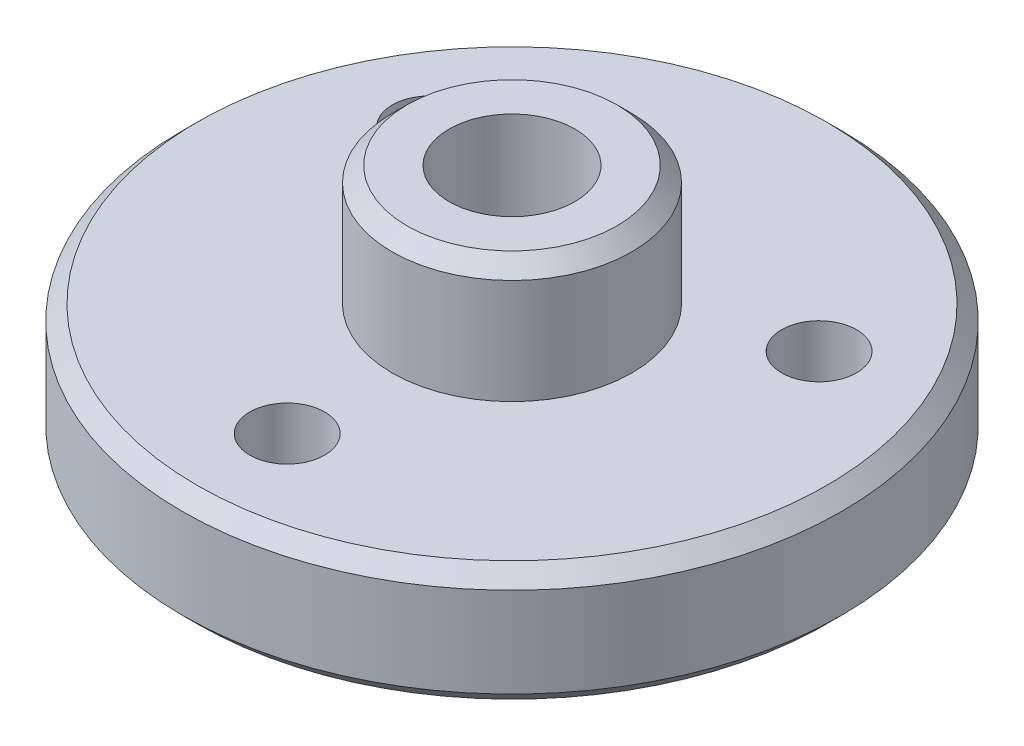
ISO-10303-21;
HEADER;
FILE_DESCRIPTION(('STEP AP214'),'2;1');
FILE_NAME('part.step','',(''),(''),'','','');
FILE_SCHEMA(('AUTOMOTIVE_DESIGN { 1 0 10303 214 1 1 1 1 }'));
ENDSEC;
DATA;
#1=APPLICATION_CONTEXT('core data for automotive mechanical design processes');
#2=APPLICATION_PROTOCOL_DEFINITION('international standard','automotive_design',2000,#1);
#3=PRODUCT_CONTEXT('',#1,'mechanical');
#4=PRODUCT('Part','Part','',(#3));
#5=PRODUCT_RELATED_PRODUCT_CATEGORY('part','',(#4));
#6=PRODUCT_DEFINITION_FORMATION('','',#4);
#7=PRODUCT_DEFINITION_CONTEXT('part definition',#1,'design');
#8=PRODUCT_DEFINITION('design','',#6,#7);
#9=PRODUCT_DEFINITION_SHAPE('','',#8);
#10=(LENGTH_UNIT() NAMED_UNIT(*) SI_UNIT(.MILLI.,.METRE.));
#11=(NAMED_UNIT(*) PLANE_ANGLE_UNIT() SI_UNIT($,.RADIAN.));
#12=(NAMED_UNIT(*) SI_UNIT($,.STERADIAN.) SOLID_ANGLE_UNIT());
#13=UNCERTAINTY_MEASURE_WITH_UNIT(LENGTH_MEASURE(1.E-05),#10,'distance_accuracy_value','');
#14=(GEOMETRIC_REPRESENTATION_CONTEXT(3) GLOBAL_UNCERTAINTY_ASSIGNED_CONTEXT((#13)) GLOBAL_UNIT_ASSIGNED_CONTEXT((#10,
#11,#12)) REPRESENTATION_CONTEXT('',''));
#15=CARTESIAN_POINT('',(0.,0.,0.));
#16=DIRECTION('',(0.,0.,1.));
#17=DIRECTION('',(1.,0.,0.));
#18=AXIS2_PLACEMENT_3D('',#15,#16,#17);
#19=CARTESIAN_POINT('',(4.,8.,0.));
#20=DIRECTION('',(0.,-1.,0.));
#21=DIRECTION('',(0.,0.,-1.));
#22=AXIS2_PLACEMENT_3D('',#19,#20,#21);
#23=PLANE('',#22);
#24=CARTESIAN_POINT('',(0.,8.,0.));
#25=DIRECTION('',(0.,-1.,0.));
#26=DIRECTION('',(0.,0.,-1.));
#27=AXIS2_PLACEMENT_3D('',#24,#25,#26);
#28=CIRCLE('',#27,3.5);
#29=CARTESIAN_POINT('',(0.,8.,-3.5));
#30=VERTEX_POINT('',#29);
#31=EDGE_CURVE('E48',#30,#30,#28,.F.);
#32=ORIENTED_EDGE('',*,*,#31,.T.);
#33=EDGE_LOOP('',(#32));
#34=FACE_BOUND('',#33,.T.);
#35=CARTESIAN_POINT('',(0.,8.,0.));
#36=DIRECTION('',(0.,-1.,0.));
#37=DIRECTION('',(0.,0.,-1.));
#38=AXIS2_PLACEMENT_3D('',#35,#36,#37);
#39=CIRCLE('',#38,2.1);
#40=CARTESIAN_POINT('',(0.,8.,-2.1));
#41=VERTEX_POINT('',#40);
#42=EDGE_CURVE('E103',#41,#41,#39,.T.);
#43=ORIENTED_EDGE('',*,*,#42,.T.);
#44=EDGE_LOOP('',(#43));
#45=FACE_BOUND('',#44,.T.);
#46=ADVANCED_FACE('F40',(#34,#45),#23,.F.);
#47=CARTESIAN_POINT('',(0.,0.,0.));
#48=DIRECTION('',(0.,1.,0.));
#49=DIRECTION('',(0.,0.,1.));
#50=AXIS2_PLACEMENT_3D('',#47,#48,#49);
#51=PLANE('',#50);
#52=CARTESIAN_POINT('',(0.,0.,0.));
#53=DIRECTION('',(0.,-1.,0.));
#54=DIRECTION('',(0.,0.,-1.));
#55=AXIS2_PLACEMENT_3D('',#52,#53,#54);
#56=CIRCLE('',#55,2.1);
#57=CARTESIAN_POINT('',(0.,0.,-2.1));
#58=VERTEX_POINT('',#57);
#59=EDGE_CURVE('E106',#58,#58,#56,.T.);
#60=ORIENTED_EDGE('',*,*,#59,.F.);
#61=EDGE_LOOP('',(#60));
#62=FACE_BOUND('',#61,.T.);
#63=CARTESIAN_POINT('',(0.,0.,0.));
#64=DIRECTION('',(0.,1.,0.));
#65=DIRECTION('',(0.,0.,1.));
#66=AXIS2_PLACEMENT_3D('',#63,#64,#65);
#67=CIRCLE('',#66,3.);
#68=CARTESIAN_POINT('',(0.,0.,3.));
#69=VERTEX_POINT('',#68);
#70=EDGE_CURVE('E73',#69,#69,#67,.T.);
#71=ORIENTED_EDGE('',*,*,#70,.F.);
#72=EDGE_LOOP('',(#71));
#73=FACE_BOUND('',#72,.T.);
#74=ADVANCED_FACE('F112',(#62,#73),#51,.F.);
#75=CARTESIAN_POINT('',(0.,0.,0.));
#76=DIRECTION('',(0.,1.,0.));
#77=DIRECTION('',(0.,0.,1.));
#78=AXIS2_PLACEMENT_3D('',#75,#76,#77);
#79=CYLINDRICAL_SURFACE('',#78,3.);
#80=CARTESIAN_POINT('',(0.,-0.9,0.));
#81=DIRECTION('',(0.,1.,0.));
#82=DIRECTION('',(0.,0.,1.));
#83=AXIS2_PLACEMENT_3D('',#80,#81,#82);
#84=CIRCLE('',#83,3.);
#85=CARTESIAN_POINT('',(0.,-0.9,3.));
#86=VERTEX_POINT('',#85);
#87=EDGE_CURVE('E76',#86,#86,#84,.T.);
#88=ORIENTED_EDGE('',*,*,#87,.F.);
#89=EDGE_LOOP('',(#88));
#90=FACE_BOUND('',#89,.T.);
#91=ORIENTED_EDGE('',*,*,#70,.T.);
#92=EDGE_LOOP('',(#91));
#93=FACE_BOUND('',#92,.T.);
#94=ADVANCED_FACE('F115',(#90,#93),#79,.F.);
#95=CARTESIAN_POINT('',(3.,-0.9,0.));
#96=DIRECTION('',(0.,1.,0.));
#97=DIRECTION('',(0.,0.,1.));
#98=AXIS2_PLACEMENT_3D('',#95,#96,#97);
#99=PLANE('',#98);
#100=CARTESIAN_POINT('',(0.,-0.9,0.));
#101=DIRECTION('',(0.,1.,0.));
#102=DIRECTION('',(0.,0.,1.));
#103=AXIS2_PLACEMENT_3D('',#100,#101,#102);
#104=CIRCLE('',#103,4.);
#105=CARTESIAN_POINT('',(0.,-0.9,4.));
#106=VERTEX_POINT('',#105);
#107=EDGE_CURVE('E79',#106,#106,#104,.T.);
#108=ORIENTED_EDGE('',*,*,#107,.F.);
#109=EDGE_LOOP('',(#108));
#110=FACE_BOUND('',#109,.T.);
#111=ORIENTED_EDGE('',*,*,#87,.T.);
#112=EDGE_LOOP('',(#111));
#113=FACE_BOUND('',#112,.T.);
#114=ADVANCED_FACE('F120',(#110,#113),#99,.F.);
#115=CARTESIAN_POINT('',(0.,0.,0.));
#116=DIRECTION('',(0.,1.,0.));
#117=DIRECTION('',(0.,0.,1.));
#118=AXIS2_PLACEMENT_3D('',#115,#116,#117);
#119=CYLINDRICAL_SURFACE('',#118,4.);
#120=CARTESIAN_POINT('',(0.,-0.499999999999994,0.));
#121=DIRECTION('',(0.,1.,0.));
#122=DIRECTION('',(0.,0.,1.));
#123=AXIS2_PLACEMENT_3D('',#120,#121,#122);
#124=CIRCLE('',#123,4.);
#125=CARTESIAN_POINT('',(0.,-0.499999999999994,4.));
#126=VERTEX_POINT('',#125);
#127=EDGE_CURVE('E64',#126,#126,#124,.F.);
#128=ORIENTED_EDGE('',*,*,#127,.T.);
#129=EDGE_LOOP('',(#128));
#130=FACE_BOUND('',#129,.T.);
#131=ORIENTED_EDGE('',*,*,#107,.T.);
#132=EDGE_LOOP('',(#131));
#133=FACE_BOUND('',#132,.T.);
#134=ADVANCED_FACE('F126',(#130,#133),#119,.T.);
#135=CARTESIAN_POINT('',(4.,0.,0.));
#136=DIRECTION('',(0.,1.,0.));
#137=DIRECTION('',(0.,0.,1.));
#138=AXIS2_PLACEMENT_3D('',#135,#136,#137);
#139=PLANE('',#138);
#140=CARTESIAN_POINT('',(0.,0.,0.));
#141=DIRECTION('',(0.,1.,0.));
#142=DIRECTION('',(0.,0.,1.));
#143=AXIS2_PLACEMENT_3D('',#140,#141,#142);
#144=CIRCLE('',#143,4.5);
#145=CARTESIAN_POINT('',(0.,0.,4.5));
#146=VERTEX_POINT('',#145);
#147=EDGE_CURVE('E67',#146,#146,#144,.T.);
#148=ORIENTED_EDGE('',*,*,#147,.T.);
#149=EDGE_LOOP('',(#148));
#150=FACE_BOUND('',#149,.T.);
#151=CARTESIAN_POINT('',(0.,0.,0.));
#152=DIRECTION('',(0.,1.,0.));
#153=DIRECTION('',(0.,0.,1.));
#154=AXIS2_PLACEMENT_3D('',#151,#152,#153);
#155=CIRCLE('',#154,10.5);
#156=CARTESIAN_POINT('',(0.,0.,10.5));
#157=VERTEX_POINT('',#156);
#158=EDGE_CURVE('E70',#157,#157,#155,.F.);
#159=ORIENTED_EDGE('',*,*,#158,.T.);
#160=EDGE_LOOP('',(#159));
#161=FACE_BOUND('',#160,.T.);
#162=CARTESIAN_POINT('',(-6.49519052838329,0.,-3.75));
#163=DIRECTION('',(0.,1.,0.));
#164=DIRECTION('',(0.,0.,1.));
#165=AXIS2_PLACEMENT_3D('',#162,#163,#164);
#166=CIRCLE('',#165,1.25);
#167=CARTESIAN_POINT('',(-6.49519052838329,0.,-2.5));
#168=VERTEX_POINT('',#167);
#169=EDGE_CURVE('E97',#168,#168,#166,.T.);
#170=ORIENTED_EDGE('',*,*,#169,.T.);
#171=EDGE_LOOP('',(#170));
#172=FACE_BOUND('',#171,.T.);
#173=CARTESIAN_POINT('',(6.49519052838329,0.,-3.75));
#174=DIRECTION('',(0.,1.,0.));
#175=DIRECTION('',(0.,0.,1.));
#176=AXIS2_PLACEMENT_3D('',#173,#174,#175);
#177=CIRCLE('',#176,1.25);
#178=CARTESIAN_POINT('',(6.49519052838329,0.,-2.5));
#179=VERTEX_POINT('',#178);
#180=EDGE_CURVE('E91',#179,#179,#177,.T.);
#181=ORIENTED_EDGE('',*,*,#180,.T.);
#182=EDGE_LOOP('',(#181));
#183=FACE_BOUND('',#182,.T.);
#184=CARTESIAN_POINT('',(0.,0.,7.5));
#185=DIRECTION('',(0.,1.,0.));
#186=DIRECTION('',(0.,0.,1.));
#187=AXIS2_PLACEMENT_3D('',#184,#185,#186);
#188=CIRCLE('',#187,1.25);
#189=CARTESIAN_POINT('',(0.,0.,8.75));
#190=VERTEX_POINT('',#189);
#191=EDGE_CURVE('E85',#190,#190,#188,.T.);
#192=ORIENTED_EDGE('',*,*,#191,.T.);
#193=EDGE_LOOP('',(#192));
#194=FACE_BOUND('',#193,.T.);
#195=ADVANCED_FACE('F190',(#150,#161,#172,#183,#194),#139,.F.);
#196=CARTESIAN_POINT('',(0.,0.,0.));
#197=DIRECTION('',(0.,1.,0.));
#198=DIRECTION('',(0.,0.,1.));
#199=AXIS2_PLACEMENT_3D('',#196,#197,#198);
#200=CYLINDRICAL_SURFACE('',#199,11.);
#201=CARTESIAN_POINT('',(0.,0.500000000000004,0.));
#202=DIRECTION('',(0.,1.,0.));
#203=DIRECTION('',(0.,0.,1.));
#204=AXIS2_PLACEMENT_3D('',#201,#202,#203);
#205=CIRCLE('',#204,11.);
#206=CARTESIAN_POINT('',(0.,0.500000000000004,11.));
#207=VERTEX_POINT('',#206);
#208=EDGE_CURVE('E56',#207,#207,#205,.T.);
#209=ORIENTED_EDGE('',*,*,#208,.T.);
#210=EDGE_LOOP('',(#209));
#211=FACE_BOUND('',#210,.T.);
#212=CARTESIAN_POINT('',(0.,3.50000000000001,0.));
#213=DIRECTION('',(0.,-1.,0.));
#214=DIRECTION('',(0.,0.,-1.));
#215=AXIS2_PLACEMENT_3D('',#212,#213,#214);
#216=CIRCLE('',#215,11.);
#217=CARTESIAN_POINT('',(0.,3.50000000000001,-11.));
#218=VERTEX_POINT('',#217);
#219=EDGE_CURVE('E61',#218,#218,#216,.T.);
#220=ORIENTED_EDGE('',*,*,#219,.T.);
#221=EDGE_LOOP('',(#220));
#222=FACE_BOUND('',#221,.T.);
#223=ADVANCED_FACE('F167',(#211,#222),#200,.T.);
#224=CARTESIAN_POINT('',(11.,4.,0.));
#225=DIRECTION('',(0.,-1.,0.));
#226=DIRECTION('',(0.,0.,-1.));
#227=AXIS2_PLACEMENT_3D('',#224,#225,#226);
#228=PLANE('',#227);
#229=CARTESIAN_POINT('',(0.,4.,0.));
#230=DIRECTION('',(0.,-1.,0.));
#231=DIRECTION('',(0.,0.,-1.));
#232=AXIS2_PLACEMENT_3D('',#229,#230,#231);
#233=CIRCLE('',#232,10.5);
#234=CARTESIAN_POINT('',(0.,4.,-10.5));
#235=VERTEX_POINT('',#234);
#236=EDGE_CURVE('E52',#235,#235,#233,.F.);
#237=ORIENTED_EDGE('',*,*,#236,.T.);
#238=EDGE_LOOP('',(#237));
#239=FACE_BOUND('',#238,.T.);
#240=CARTESIAN_POINT('',(-6.49519052838329,4.,-3.75));
#241=DIRECTION('',(0.,1.,0.));
#242=DIRECTION('',(0.,0.,1.));
#243=AXIS2_PLACEMENT_3D('',#240,#241,#242);
#244=CIRCLE('',#243,1.25);
#245=CARTESIAN_POINT('',(-6.49519052838329,4.,-2.5));
#246=VERTEX_POINT('',#245);
#247=EDGE_CURVE('E100',#246,#246,#244,.T.);
#248=ORIENTED_EDGE('',*,*,#247,.F.);
#249=EDGE_LOOP('',(#248));
#250=FACE_BOUND('',#249,.T.);
#251=CARTESIAN_POINT('',(6.49519052838329,4.,-3.75));
#252=DIRECTION('',(0.,1.,0.));
#253=DIRECTION('',(0.,0.,1.));
#254=AXIS2_PLACEMENT_3D('',#251,#252,#253);
#255=CIRCLE('',#254,1.25);
#256=CARTESIAN_POINT('',(6.49519052838329,4.,-2.5));
#257=VERTEX_POINT('',#256);
#258=EDGE_CURVE('E94',#257,#257,#255,.T.);
#259=ORIENTED_EDGE('',*,*,#258,.F.);
#260=EDGE_LOOP('',(#259));
#261=FACE_BOUND('',#260,.T.);
#262=CARTESIAN_POINT('',(0.,4.,7.5));
#263=DIRECTION('',(0.,1.,0.));
#264=DIRECTION('',(0.,0.,1.));
#265=AXIS2_PLACEMENT_3D('',#262,#263,#264);
#266=CIRCLE('',#265,1.25);
#267=CARTESIAN_POINT('',(0.,4.,8.75));
#268=VERTEX_POINT('',#267);
#269=EDGE_CURVE('E88',#268,#268,#266,.T.);
#270=ORIENTED_EDGE('',*,*,#269,.F.);
#271=EDGE_LOOP('',(#270));
#272=FACE_BOUND('',#271,.T.);
#273=CARTESIAN_POINT('',(0.,4.,0.));
#274=DIRECTION('',(0.,1.,0.));
#275=DIRECTION('',(0.,0.,1.));
#276=AXIS2_PLACEMENT_3D('',#273,#274,#275);
#277=CIRCLE('',#276,4.);
#278=CARTESIAN_POINT('',(0.,4.,4.));
#279=VERTEX_POINT('',#278);
#280=EDGE_CURVE('E82',#279,#279,#277,.T.);
#281=ORIENTED_EDGE('',*,*,#280,.F.);
#282=EDGE_LOOP('',(#281));
#283=FACE_BOUND('',#282,.T.);
#284=ADVANCED_FACE('F163',(#239,#250,#261,#272,#283),#228,.F.);
#285=CARTESIAN_POINT('',(0.,0.,0.));
#286=DIRECTION('',(0.,1.,0.));
#287=DIRECTION('',(0.,0.,1.));
#288=AXIS2_PLACEMENT_3D('',#285,#286,#287);
#289=CYLINDRICAL_SURFACE('',#288,4.);
#290=CARTESIAN_POINT('',(0.,7.5,0.));
#291=DIRECTION('',(0.,-1.,0.));
#292=DIRECTION('',(0.,0.,-1.));
#293=AXIS2_PLACEMENT_3D('',#290,#291,#292);
#294=CIRCLE('',#293,4.);
#295=CARTESIAN_POINT('',(0.,7.5,-4.));
#296=VERTEX_POINT('',#295);
#297=EDGE_CURVE('E10',#296,#296,#294,.T.);
#298=ORIENTED_EDGE('',*,*,#297,.T.);
#299=EDGE_LOOP('',(#298));
#300=FACE_BOUND('',#299,.T.);
#301=ORIENTED_EDGE('',*,*,#280,.T.);
#302=EDGE_LOOP('',(#301));
#303=FACE_BOUND('',#302,.T.);
#304=ADVANCED_FACE('F166',(#300,#303),#289,.T.);
#305=CARTESIAN_POINT('',(0.,4.,7.5));
#306=DIRECTION('',(0.,1.,0.));
#307=DIRECTION('',(0.,0.,1.));
#308=AXIS2_PLACEMENT_3D('',#305,#306,#307);
#309=CYLINDRICAL_SURFACE('',#308,1.25);
#310=ORIENTED_EDGE('',*,*,#269,.T.);
#311=EDGE_LOOP('',(#310));
#312=FACE_BOUND('',#311,.T.);
#313=ORIENTED_EDGE('',*,*,#191,.F.);
#314=EDGE_LOOP('',(#313));
#315=FACE_BOUND('',#314,.T.);
#316=ADVANCED_FACE('F178',(#312,#315),#309,.F.);
#317=CARTESIAN_POINT('',(6.49519052838329,4.,-3.75));
#318=DIRECTION('',(0.,1.,0.));
#319=DIRECTION('',(0.,0.,1.));
#320=AXIS2_PLACEMENT_3D('',#317,#318,#319);
#321=CYLINDRICAL_SURFACE('',#320,1.25);
#322=ORIENTED_EDGE('',*,*,#258,.T.);
#323=EDGE_LOOP('',(#322));
#324=FACE_BOUND('',#323,.T.);
#325=ORIENTED_EDGE('',*,*,#180,.F.);
#326=EDGE_LOOP('',(#325));
#327=FACE_BOUND('',#326,.T.);
#328=ADVANCED_FACE('F183',(#324,#327),#321,.F.);
#329=CARTESIAN_POINT('',(-6.49519052838329,4.,-3.75));
#330=DIRECTION('',(0.,1.,0.));
#331=DIRECTION('',(0.,0.,1.));
#332=AXIS2_PLACEMENT_3D('',#329,#330,#331);
#333=CYLINDRICAL_SURFACE('',#332,1.25);
#334=ORIENTED_EDGE('',*,*,#247,.T.);
#335=EDGE_LOOP('',(#334));
#336=FACE_BOUND('',#335,.T.);
#337=ORIENTED_EDGE('',*,*,#169,.F.);
#338=EDGE_LOOP('',(#337));
#339=FACE_BOUND('',#338,.T.);
#340=ADVANCED_FACE('F216',(#336,#339),#333,.F.);
#341=CARTESIAN_POINT('',(0.,0.,0.));
#342=DIRECTION('',(0.,-1.,0.));
#343=DIRECTION('',(0.,0.,-1.));
#344=AXIS2_PLACEMENT_3D('',#341,#342,#343);
#345=CYLINDRICAL_SURFACE('',#344,2.1);
#346=ORIENTED_EDGE('',*,*,#42,.F.);
#347=EDGE_LOOP('',(#346));
#348=FACE_BOUND('',#347,.T.);
#349=ORIENTED_EDGE('',*,*,#59,.T.);
#350=EDGE_LOOP('',(#349));
#351=FACE_BOUND('',#350,.T.);
#352=ADVANCED_FACE('F110',(#348,#351),#345,.F.);
#353=CARTESIAN_POINT('',(0.,0.,0.));
#354=DIRECTION('',(0.,1.,0.));
#355=DIRECTION('',(0.,0.,1.));
#356=AXIS2_PLACEMENT_3D('',#353,#354,#355);
#357=CONICAL_SURFACE('',#356,4.5,0.785398163397452);
#358=ORIENTED_EDGE('',*,*,#127,.F.);
#359=EDGE_LOOP('',(#358));
#360=FACE_BOUND('',#359,.T.);
#361=ORIENTED_EDGE('',*,*,#147,.F.);
#362=EDGE_LOOP('',(#361));
#363=FACE_BOUND('',#362,.T.);
#364=ADVANCED_FACE('F137',(#360,#363),#357,.T.);
#365=CARTESIAN_POINT('',(0.,0.500000000000004,0.));
#366=DIRECTION('',(0.,1.,0.));
#367=DIRECTION('',(0.,0.,1.));
#368=AXIS2_PLACEMENT_3D('',#365,#366,#367);
#369=CONICAL_SURFACE('',#368,11.,0.785398163397453);
#370=ORIENTED_EDGE('',*,*,#158,.F.);
#371=EDGE_LOOP('',(#370));
#372=FACE_BOUND('',#371,.T.);
#373=ORIENTED_EDGE('',*,*,#208,.F.);
#374=EDGE_LOOP('',(#373));
#375=FACE_BOUND('',#374,.T.);
#376=ADVANCED_FACE('F143',(#372,#375),#369,.T.);
#377=CARTESIAN_POINT('',(0.,4.,0.));
#378=DIRECTION('',(0.,-1.,0.));
#379=DIRECTION('',(0.,0.,-1.));
#380=AXIS2_PLACEMENT_3D('',#377,#378,#379);
#381=CONICAL_SURFACE('',#380,10.5,0.785398163397448);
#382=ORIENTED_EDGE('',*,*,#219,.F.);
#383=EDGE_LOOP('',(#382));
#384=FACE_BOUND('',#383,.T.);
#385=ORIENTED_EDGE('',*,*,#236,.F.);
#386=EDGE_LOOP('',(#385));
#387=FACE_BOUND('',#386,.T.);
#388=ADVANCED_FACE('F149',(#384,#387),#381,.T.);
#389=CARTESIAN_POINT('',(0.,8.,0.));
#390=DIRECTION('',(0.,-1.,0.));
#391=DIRECTION('',(0.,0.,-1.));
#392=AXIS2_PLACEMENT_3D('',#389,#390,#391);
#393=CONICAL_SURFACE('',#392,3.5,0.785398163397448);
#394=ORIENTED_EDGE('',*,*,#297,.F.);
#395=EDGE_LOOP('',(#394));
#396=FACE_BOUND('',#395,.T.);
#397=ORIENTED_EDGE('',*,*,#31,.F.);
#398=EDGE_LOOP('',(#397));
#399=FACE_BOUND('',#398,.T.);
#400=ADVANCED_FACE('F43',(#396,#399),#393,.T.);
#401=CLOSED_SHELL('',(#46,#74,#94,#114,#134,#195,#223,#284,#304,#316,#328,#340,#352,#364,#376,
#388,#400));
#402=MANIFOLD_SOLID_BREP('B2',#401);
#403=ADVANCED_BREP_SHAPE_REPRESENTATION('',(#18,#402),#14);
#404=SHAPE_DEFINITION_REPRESENTATION(#9,#403);
ENDSEC;
END-ISO-10303-21;
